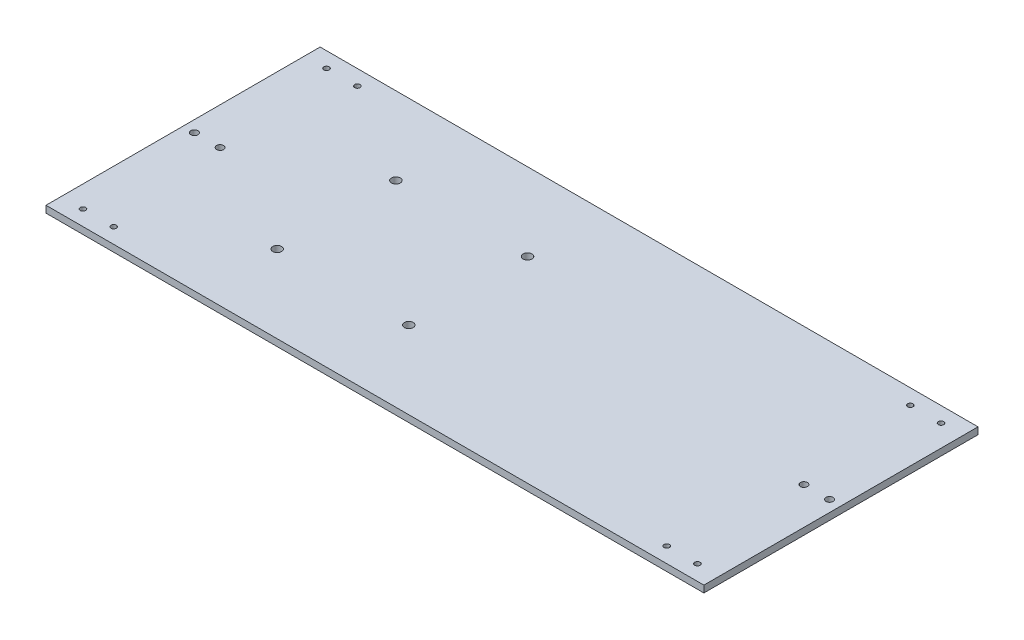
ISO-10303-21;
HEADER;
FILE_DESCRIPTION(('STEP AP214'),'2;1');
FILE_NAME('part.step','',(''),(''),'','','');
FILE_SCHEMA(('AUTOMOTIVE_DESIGN { 1 0 10303 214 1 1 1 1 }'));
ENDSEC;
DATA;
#1=APPLICATION_CONTEXT('core data for automotive mechanical design processes');
#2=APPLICATION_PROTOCOL_DEFINITION('international standard','automotive_design',2000,#1);
#3=PRODUCT_CONTEXT('',#1,'mechanical');
#4=PRODUCT('Part','Part','',(#3));
#5=PRODUCT_RELATED_PRODUCT_CATEGORY('part','',(#4));
#6=PRODUCT_DEFINITION_FORMATION('','',#4);
#7=PRODUCT_DEFINITION_CONTEXT('part definition',#1,'design');
#8=PRODUCT_DEFINITION('design','',#6,#7);
#9=PRODUCT_DEFINITION_SHAPE('','',#8);
#10=(LENGTH_UNIT() NAMED_UNIT(*) SI_UNIT(.MILLI.,.METRE.));
#11=(NAMED_UNIT(*) PLANE_ANGLE_UNIT() SI_UNIT($,.RADIAN.));
#12=(NAMED_UNIT(*) SI_UNIT($,.STERADIAN.) SOLID_ANGLE_UNIT());
#13=UNCERTAINTY_MEASURE_WITH_UNIT(LENGTH_MEASURE(1.E-05),#10,'distance_accuracy_value','');
#14=(GEOMETRIC_REPRESENTATION_CONTEXT(3) GLOBAL_UNCERTAINTY_ASSIGNED_CONTEXT((#13)) GLOBAL_UNIT_ASSIGNED_CONTEXT((#10,
#11,#12)) REPRESENTATION_CONTEXT('',''));
#15=CARTESIAN_POINT('',(0.,0.,0.));
#16=DIRECTION('',(0.,0.,1.));
#17=DIRECTION('',(1.,0.,0.));
#18=AXIS2_PLACEMENT_3D('',#15,#16,#17);
#19=CARTESIAN_POINT('',(0.,6.35,0.));
#20=DIRECTION('',(0.,-1.,0.));
#21=DIRECTION('',(0.,0.,-1.));
#22=AXIS2_PLACEMENT_3D('',#19,#20,#21);
#23=PLANE('',#22);
#24=DIRECTION('',(1.,0.,0.));
#25=VECTOR('',#24,1.);
#26=CARTESIAN_POINT('',(0.,6.35,0.));
#27=LINE('',#26,#25);
#28=CARTESIAN_POINT('',(0.,6.35,0.));
#29=VERTEX_POINT('',#28);
#30=CARTESIAN_POINT('',(609.6,6.35,0.));
#31=VERTEX_POINT('',#30);
#32=EDGE_CURVE('E85',#29,#31,#27,.T.);
#33=ORIENTED_EDGE('',*,*,#32,.T.);
#34=DIRECTION('',(0.,0.,-1.));
#35=VECTOR('',#34,1.);
#36=CARTESIAN_POINT('',(609.6,6.35,-254.));
#37=LINE('',#36,#35);
#38=CARTESIAN_POINT('',(609.6,6.35,-254.));
#39=VERTEX_POINT('',#38);
#40=EDGE_CURVE('E80',#31,#39,#37,.T.);
#41=ORIENTED_EDGE('',*,*,#40,.T.);
#42=DIRECTION('',(-1.,0.,0.));
#43=VECTOR('',#42,1.);
#44=CARTESIAN_POINT('',(0.,6.35,-254.));
#45=LINE('',#44,#43);
#46=CARTESIAN_POINT('',(0.,6.35,-254.));
#47=VERTEX_POINT('',#46);
#48=EDGE_CURVE('E83',#39,#47,#45,.T.);
#49=ORIENTED_EDGE('',*,*,#48,.T.);
#50=DIRECTION('',(0.,0.,1.));
#51=VECTOR('',#50,1.);
#52=CARTESIAN_POINT('',(0.,6.35,0.));
#53=LINE('',#52,#51);
#54=EDGE_CURVE('E50',#47,#29,#53,.T.);
#55=ORIENTED_EDGE('',*,*,#54,.T.);
#56=EDGE_LOOP('',(#33,#41,#49,#55));
#57=FACE_BOUND('',#56,.T.);
#58=CARTESIAN_POINT('',(20.1062344075867,6.35,-14.145554391547));
#59=DIRECTION('',(0.,1.,0.));
#60=DIRECTION('',(0.,0.,1.));
#61=AXIS2_PLACEMENT_3D('',#58,#59,#60);
#62=CIRCLE('',#61,2.5);
#63=CARTESIAN_POINT('',(20.1062344075867,6.35,-11.645554391547));
#64=VERTEX_POINT('',#63);
#65=EDGE_CURVE('E100',#64,#64,#62,.T.);
#66=ORIENTED_EDGE('',*,*,#65,.F.);
#67=EDGE_LOOP('',(#66));
#68=FACE_BOUND('',#67,.T.);
#69=CARTESIAN_POINT('',(48.6062344075867,6.35,-14.145554391547));
#70=DIRECTION('',(0.,1.,0.));
#71=DIRECTION('',(0.,0.,1.));
#72=AXIS2_PLACEMENT_3D('',#69,#70,#71);
#73=CIRCLE('',#72,2.49999999999999);
#74=CARTESIAN_POINT('',(48.6062344075867,6.35,-11.645554391547));
#75=VERTEX_POINT('',#74);
#76=EDGE_CURVE('E115',#75,#75,#73,.T.);
#77=ORIENTED_EDGE('',*,*,#76,.F.);
#78=EDGE_LOOP('',(#77));
#79=FACE_BOUND('',#78,.T.);
#80=CARTESIAN_POINT('',(560.993765592413,6.35,-14.1455543915467));
#81=DIRECTION('',(0.,1.,0.));
#82=DIRECTION('',(0.,0.,-1.));
#83=AXIS2_PLACEMENT_3D('',#80,#81,#82);
#84=CIRCLE('',#83,2.50000000000013);
#85=CARTESIAN_POINT('',(560.993765592413,6.35,-16.6455543915469));
#86=VERTEX_POINT('',#85);
#87=EDGE_CURVE('E121',#86,#86,#84,.T.);
#88=ORIENTED_EDGE('',*,*,#87,.F.);
#89=EDGE_LOOP('',(#88));
#90=FACE_BOUND('',#89,.T.);
#91=CARTESIAN_POINT('',(589.493765592413,6.35,-14.1455543915467));
#92=DIRECTION('',(0.,1.,0.));
#93=DIRECTION('',(0.,0.,-1.));
#94=AXIS2_PLACEMENT_3D('',#91,#92,#93);
#95=CIRCLE('',#94,2.49999999999992);
#96=CARTESIAN_POINT('',(589.493765592413,6.35,-16.6455543915466));
#97=VERTEX_POINT('',#96);
#98=EDGE_CURVE('E127',#97,#97,#95,.T.);
#99=ORIENTED_EDGE('',*,*,#98,.F.);
#100=EDGE_LOOP('',(#99));
#101=FACE_BOUND('',#100,.T.);
#102=CARTESIAN_POINT('',(589.493765592413,6.35,-239.854445608453));
#103=DIRECTION('',(0.,1.,0.));
#104=DIRECTION('',(0.,0.,1.));
#105=AXIS2_PLACEMENT_3D('',#102,#103,#104);
#106=CIRCLE('',#105,2.49999999999992);
#107=CARTESIAN_POINT('',(589.493765592413,6.35,-237.354445608453));
#108=VERTEX_POINT('',#107);
#109=EDGE_CURVE('E133',#108,#108,#106,.T.);
#110=ORIENTED_EDGE('',*,*,#109,.F.);
#111=EDGE_LOOP('',(#110));
#112=FACE_BOUND('',#111,.T.);
#113=CARTESIAN_POINT('',(560.993765592413,6.35,-239.854445608453));
#114=DIRECTION('',(0.,1.,0.));
#115=DIRECTION('',(0.,0.,1.));
#116=AXIS2_PLACEMENT_3D('',#113,#114,#115);
#117=CIRCLE('',#116,2.50000000000013);
#118=CARTESIAN_POINT('',(560.993765592413,6.35,-237.354445608453));
#119=VERTEX_POINT('',#118);
#120=EDGE_CURVE('E139',#119,#119,#117,.T.);
#121=ORIENTED_EDGE('',*,*,#120,.F.);
#122=EDGE_LOOP('',(#121));
#123=FACE_BOUND('',#122,.T.);
#124=CARTESIAN_POINT('',(48.6062344075867,6.35,-239.854445608453));
#125=DIRECTION('',(0.,1.,0.));
#126=DIRECTION('',(0.,0.,-1.));
#127=AXIS2_PLACEMENT_3D('',#124,#125,#126);
#128=CIRCLE('',#127,2.5);
#129=CARTESIAN_POINT('',(48.6062344075867,6.35,-242.354445608453));
#130=VERTEX_POINT('',#129);
#131=EDGE_CURVE('E145',#130,#130,#128,.T.);
#132=ORIENTED_EDGE('',*,*,#131,.F.);
#133=EDGE_LOOP('',(#132));
#134=FACE_BOUND('',#133,.T.);
#135=CARTESIAN_POINT('',(20.1062344075867,6.35,-239.854445608453));
#136=DIRECTION('',(0.,1.,0.));
#137=DIRECTION('',(0.,0.,-1.));
#138=AXIS2_PLACEMENT_3D('',#135,#136,#137);
#139=CIRCLE('',#138,2.5);
#140=CARTESIAN_POINT('',(20.1062344075867,6.35,-242.354445608453));
#141=VERTEX_POINT('',#140);
#142=EDGE_CURVE('E151',#141,#141,#139,.T.);
#143=ORIENTED_EDGE('',*,*,#142,.F.);
#144=EDGE_LOOP('',(#143));
#145=FACE_BOUND('',#144,.T.);
#146=CARTESIAN_POINT('',(575.243765592413,6.35,-127.));
#147=DIRECTION('',(0.,1.,0.));
#148=DIRECTION('',(0.,0.,1.));
#149=AXIS2_PLACEMENT_3D('',#146,#147,#148);
#150=CIRCLE('',#149,3.30200000000002);
#151=CARTESIAN_POINT('',(575.243765592413,6.35,-123.698));
#152=VERTEX_POINT('',#151);
#153=EDGE_CURVE('E157',#152,#152,#150,.T.);
#154=ORIENTED_EDGE('',*,*,#153,.F.);
#155=EDGE_LOOP('',(#154));
#156=FACE_BOUND('',#155,.T.);
#157=CARTESIAN_POINT('',(599.056265592413,6.35,-127.));
#158=DIRECTION('',(0.,1.,0.));
#159=DIRECTION('',(0.,0.,1.));
#160=AXIS2_PLACEMENT_3D('',#157,#158,#159);
#161=CIRCLE('',#160,3.30200000000002);
#162=CARTESIAN_POINT('',(599.056265592413,6.35,-123.698));
#163=VERTEX_POINT('',#162);
#164=EDGE_CURVE('E163',#163,#163,#161,.T.);
#165=ORIENTED_EDGE('',*,*,#164,.F.);
#166=EDGE_LOOP('',(#165));
#167=FACE_BOUND('',#166,.T.);
#168=CARTESIAN_POINT('',(10.5437344075867,6.35,-127.));
#169=DIRECTION('',(0.,1.,0.));
#170=DIRECTION('',(0.,0.,1.));
#171=AXIS2_PLACEMENT_3D('',#168,#169,#170);
#172=CIRCLE('',#171,3.30200000000002);
#173=CARTESIAN_POINT('',(10.5437344075867,6.35,-123.698));
#174=VERTEX_POINT('',#173);
#175=EDGE_CURVE('E169',#174,#174,#172,.T.);
#176=ORIENTED_EDGE('',*,*,#175,.F.);
#177=EDGE_LOOP('',(#176));
#178=FACE_BOUND('',#177,.T.);
#179=CARTESIAN_POINT('',(34.3562344075867,6.35,-127.));
#180=DIRECTION('',(0.,1.,0.));
#181=DIRECTION('',(0.,0.,1.));
#182=AXIS2_PLACEMENT_3D('',#179,#180,#181);
#183=CIRCLE('',#182,3.30200000000002);
#184=CARTESIAN_POINT('',(34.3562344075867,6.35,-123.698));
#185=VERTEX_POINT('',#184);
#186=EDGE_CURVE('E175',#185,#185,#183,.T.);
#187=ORIENTED_EDGE('',*,*,#186,.F.);
#188=EDGE_LOOP('',(#187));
#189=FACE_BOUND('',#188,.T.);
#190=CARTESIAN_POINT('',(142.2,6.35,-72.));
#191=DIRECTION('',(0.,1.,0.));
#192=DIRECTION('',(0.,0.,1.));
#193=AXIS2_PLACEMENT_3D('',#190,#191,#192);
#194=CIRCLE('',#193,4.09999999999998);
#195=CARTESIAN_POINT('',(142.2,6.35,-67.9));
#196=VERTEX_POINT('',#195);
#197=EDGE_CURVE('E181',#196,#196,#194,.T.);
#198=ORIENTED_EDGE('',*,*,#197,.F.);
#199=EDGE_LOOP('',(#198));
#200=FACE_BOUND('',#199,.T.);
#201=CARTESIAN_POINT('',(142.2,6.35,-182.));
#202=DIRECTION('',(0.,1.,0.));
#203=DIRECTION('',(0.,0.,1.));
#204=AXIS2_PLACEMENT_3D('',#201,#202,#203);
#205=CIRCLE('',#204,4.09999999999998);
#206=CARTESIAN_POINT('',(142.2,6.35,-177.9));
#207=VERTEX_POINT('',#206);
#208=EDGE_CURVE('E187',#207,#207,#205,.T.);
#209=ORIENTED_EDGE('',*,*,#208,.F.);
#210=EDGE_LOOP('',(#209));
#211=FACE_BOUND('',#210,.T.);
#212=CARTESIAN_POINT('',(264.2,6.35,-182.));
#213=DIRECTION('',(0.,1.,0.));
#214=DIRECTION('',(0.,0.,-1.));
#215=AXIS2_PLACEMENT_3D('',#212,#213,#214);
#216=CIRCLE('',#215,4.10000000000004);
#217=CARTESIAN_POINT('',(264.2,6.35,-186.1));
#218=VERTEX_POINT('',#217);
#219=EDGE_CURVE('E193',#218,#218,#216,.T.);
#220=ORIENTED_EDGE('',*,*,#219,.F.);
#221=EDGE_LOOP('',(#220));
#222=FACE_BOUND('',#221,.T.);
#223=CARTESIAN_POINT('',(264.2,6.35,-72.));
#224=DIRECTION('',(0.,1.,0.));
#225=DIRECTION('',(0.,0.,-1.));
#226=AXIS2_PLACEMENT_3D('',#223,#224,#225);
#227=CIRCLE('',#226,4.10000000000004);
#228=CARTESIAN_POINT('',(264.2,6.35,-76.1));
#229=VERTEX_POINT('',#228);
#230=EDGE_CURVE('E199',#229,#229,#227,.T.);
#231=ORIENTED_EDGE('',*,*,#230,.F.);
#232=EDGE_LOOP('',(#231));
#233=FACE_BOUND('',#232,.T.);
#234=ADVANCED_FACE('F33',(#57,#68,#79,#90,#101,#112,#123,#134,#145,#156,#167,#178,#189,#200,
#211,#222,#233),#23,.F.);
#235=CARTESIAN_POINT('',(0.,0.,0.));
#236=DIRECTION('',(0.,-1.,0.));
#237=DIRECTION('',(0.,0.,-1.));
#238=AXIS2_PLACEMENT_3D('',#235,#236,#237);
#239=PLANE('',#238);
#240=CARTESIAN_POINT('',(264.2,0.,-182.));
#241=DIRECTION('',(0.,1.,0.));
#242=DIRECTION('',(0.,0.,-1.));
#243=AXIS2_PLACEMENT_3D('',#240,#241,#242);
#244=CIRCLE('',#243,4.10000000000004);
#245=CARTESIAN_POINT('',(264.2,0.,-186.1));
#246=VERTEX_POINT('',#245);
#247=EDGE_CURVE('E196',#246,#246,#244,.T.);
#248=ORIENTED_EDGE('',*,*,#247,.T.);
#249=EDGE_LOOP('',(#248));
#250=FACE_BOUND('',#249,.T.);
#251=CARTESIAN_POINT('',(142.2,0.,-72.));
#252=DIRECTION('',(0.,1.,0.));
#253=DIRECTION('',(0.,0.,1.));
#254=AXIS2_PLACEMENT_3D('',#251,#252,#253);
#255=CIRCLE('',#254,4.09999999999998);
#256=CARTESIAN_POINT('',(142.2,0.,-67.9));
#257=VERTEX_POINT('',#256);
#258=EDGE_CURVE('E184',#257,#257,#255,.T.);
#259=ORIENTED_EDGE('',*,*,#258,.T.);
#260=EDGE_LOOP('',(#259));
#261=FACE_BOUND('',#260,.T.);
#262=CARTESIAN_POINT('',(10.5437344075867,0.,-127.));
#263=DIRECTION('',(0.,1.,0.));
#264=DIRECTION('',(0.,0.,1.));
#265=AXIS2_PLACEMENT_3D('',#262,#263,#264);
#266=CIRCLE('',#265,3.30200000000002);
#267=CARTESIAN_POINT('',(10.5437344075867,0.,-123.698));
#268=VERTEX_POINT('',#267);
#269=EDGE_CURVE('E172',#268,#268,#266,.T.);
#270=ORIENTED_EDGE('',*,*,#269,.T.);
#271=EDGE_LOOP('',(#270));
#272=FACE_BOUND('',#271,.T.);
#273=CARTESIAN_POINT('',(575.243765592413,0.,-127.));
#274=DIRECTION('',(0.,1.,0.));
#275=DIRECTION('',(0.,0.,1.));
#276=AXIS2_PLACEMENT_3D('',#273,#274,#275);
#277=CIRCLE('',#276,3.30200000000002);
#278=CARTESIAN_POINT('',(575.243765592413,0.,-123.698));
#279=VERTEX_POINT('',#278);
#280=EDGE_CURVE('E160',#279,#279,#277,.T.);
#281=ORIENTED_EDGE('',*,*,#280,.T.);
#282=EDGE_LOOP('',(#281));
#283=FACE_BOUND('',#282,.T.);
#284=CARTESIAN_POINT('',(48.6062344075867,0.,-239.854445608453));
#285=DIRECTION('',(0.,1.,0.));
#286=DIRECTION('',(0.,0.,-1.));
#287=AXIS2_PLACEMENT_3D('',#284,#285,#286);
#288=CIRCLE('',#287,2.5);
#289=CARTESIAN_POINT('',(48.6062344075867,0.,-242.354445608453));
#290=VERTEX_POINT('',#289);
#291=EDGE_CURVE('E148',#290,#290,#288,.T.);
#292=ORIENTED_EDGE('',*,*,#291,.T.);
#293=EDGE_LOOP('',(#292));
#294=FACE_BOUND('',#293,.T.);
#295=CARTESIAN_POINT('',(589.493765592413,0.,-239.854445608453));
#296=DIRECTION('',(0.,1.,0.));
#297=DIRECTION('',(0.,0.,1.));
#298=AXIS2_PLACEMENT_3D('',#295,#296,#297);
#299=CIRCLE('',#298,2.49999999999992);
#300=CARTESIAN_POINT('',(589.493765592413,0.,-237.354445608453));
#301=VERTEX_POINT('',#300);
#302=EDGE_CURVE('E136',#301,#301,#299,.T.);
#303=ORIENTED_EDGE('',*,*,#302,.T.);
#304=EDGE_LOOP('',(#303));
#305=FACE_BOUND('',#304,.T.);
#306=CARTESIAN_POINT('',(560.993765592413,0.,-14.1455543915467));
#307=DIRECTION('',(0.,1.,0.));
#308=DIRECTION('',(0.,0.,-1.));
#309=AXIS2_PLACEMENT_3D('',#306,#307,#308);
#310=CIRCLE('',#309,2.50000000000013);
#311=CARTESIAN_POINT('',(560.993765592413,0.,-16.6455543915469));
#312=VERTEX_POINT('',#311);
#313=EDGE_CURVE('E124',#312,#312,#310,.T.);
#314=ORIENTED_EDGE('',*,*,#313,.T.);
#315=EDGE_LOOP('',(#314));
#316=FACE_BOUND('',#315,.T.);
#317=CARTESIAN_POINT('',(20.1062344075867,0.,-14.145554391547));
#318=DIRECTION('',(0.,1.,0.));
#319=DIRECTION('',(0.,0.,1.));
#320=AXIS2_PLACEMENT_3D('',#317,#318,#319);
#321=CIRCLE('',#320,2.5);
#322=CARTESIAN_POINT('',(20.1062344075867,0.,-11.645554391547));
#323=VERTEX_POINT('',#322);
#324=EDGE_CURVE('E112',#323,#323,#321,.T.);
#325=ORIENTED_EDGE('',*,*,#324,.T.);
#326=EDGE_LOOP('',(#325));
#327=FACE_BOUND('',#326,.T.);
#328=DIRECTION('',(1.,0.,0.));
#329=VECTOR('',#328,1.);
#330=CARTESIAN_POINT('',(0.,0.,0.));
#331=LINE('',#330,#329);
#332=CARTESIAN_POINT('',(0.,0.,0.));
#333=VERTEX_POINT('',#332);
#334=CARTESIAN_POINT('',(609.6,0.,0.));
#335=VERTEX_POINT('',#334);
#336=EDGE_CURVE('E97',#333,#335,#331,.T.);
#337=ORIENTED_EDGE('',*,*,#336,.F.);
#338=DIRECTION('',(0.,0.,1.));
#339=VECTOR('',#338,1.);
#340=CARTESIAN_POINT('',(0.,0.,0.));
#341=LINE('',#340,#339);
#342=CARTESIAN_POINT('',(0.,0.,-254.));
#343=VERTEX_POINT('',#342);
#344=EDGE_CURVE('E73',#343,#333,#341,.T.);
#345=ORIENTED_EDGE('',*,*,#344,.F.);
#346=DIRECTION('',(-1.,0.,0.));
#347=VECTOR('',#346,1.);
#348=CARTESIAN_POINT('',(0.,0.,-254.));
#349=LINE('',#348,#347);
#350=CARTESIAN_POINT('',(609.6,0.,-254.));
#351=VERTEX_POINT('',#350);
#352=EDGE_CURVE('E67',#351,#343,#349,.T.);
#353=ORIENTED_EDGE('',*,*,#352,.F.);
#354=DIRECTION('',(0.,0.,-1.));
#355=VECTOR('',#354,1.);
#356=CARTESIAN_POINT('',(609.6,0.,-254.));
#357=LINE('',#356,#355);
#358=EDGE_CURVE('E89',#335,#351,#357,.T.);
#359=ORIENTED_EDGE('',*,*,#358,.F.);
#360=EDGE_LOOP('',(#337,#345,#353,#359));
#361=FACE_BOUND('',#360,.T.);
#362=CARTESIAN_POINT('',(48.6062344075867,0.,-14.145554391547));
#363=DIRECTION('',(0.,1.,0.));
#364=DIRECTION('',(0.,0.,1.));
#365=AXIS2_PLACEMENT_3D('',#362,#363,#364);
#366=CIRCLE('',#365,2.49999999999999);
#367=CARTESIAN_POINT('',(48.6062344075867,0.,-11.645554391547));
#368=VERTEX_POINT('',#367);
#369=EDGE_CURVE('E118',#368,#368,#366,.T.);
#370=ORIENTED_EDGE('',*,*,#369,.T.);
#371=EDGE_LOOP('',(#370));
#372=FACE_BOUND('',#371,.T.);
#373=CARTESIAN_POINT('',(589.493765592413,0.,-14.1455543915467));
#374=DIRECTION('',(0.,1.,0.));
#375=DIRECTION('',(0.,0.,-1.));
#376=AXIS2_PLACEMENT_3D('',#373,#374,#375);
#377=CIRCLE('',#376,2.49999999999992);
#378=CARTESIAN_POINT('',(589.493765592413,0.,-16.6455543915466));
#379=VERTEX_POINT('',#378);
#380=EDGE_CURVE('E130',#379,#379,#377,.T.);
#381=ORIENTED_EDGE('',*,*,#380,.T.);
#382=EDGE_LOOP('',(#381));
#383=FACE_BOUND('',#382,.T.);
#384=CARTESIAN_POINT('',(560.993765592413,0.,-239.854445608453));
#385=DIRECTION('',(0.,1.,0.));
#386=DIRECTION('',(0.,0.,1.));
#387=AXIS2_PLACEMENT_3D('',#384,#385,#386);
#388=CIRCLE('',#387,2.50000000000013);
#389=CARTESIAN_POINT('',(560.993765592413,0.,-237.354445608453));
#390=VERTEX_POINT('',#389);
#391=EDGE_CURVE('E142',#390,#390,#388,.T.);
#392=ORIENTED_EDGE('',*,*,#391,.T.);
#393=EDGE_LOOP('',(#392));
#394=FACE_BOUND('',#393,.T.);
#395=CARTESIAN_POINT('',(20.1062344075867,0.,-239.854445608453));
#396=DIRECTION('',(0.,1.,0.));
#397=DIRECTION('',(0.,0.,-1.));
#398=AXIS2_PLACEMENT_3D('',#395,#396,#397);
#399=CIRCLE('',#398,2.5);
#400=CARTESIAN_POINT('',(20.1062344075867,0.,-242.354445608453));
#401=VERTEX_POINT('',#400);
#402=EDGE_CURVE('E154',#401,#401,#399,.T.);
#403=ORIENTED_EDGE('',*,*,#402,.T.);
#404=EDGE_LOOP('',(#403));
#405=FACE_BOUND('',#404,.T.);
#406=CARTESIAN_POINT('',(599.056265592413,0.,-127.));
#407=DIRECTION('',(0.,1.,0.));
#408=DIRECTION('',(0.,0.,1.));
#409=AXIS2_PLACEMENT_3D('',#406,#407,#408);
#410=CIRCLE('',#409,3.30200000000002);
#411=CARTESIAN_POINT('',(599.056265592413,0.,-123.698));
#412=VERTEX_POINT('',#411);
#413=EDGE_CURVE('E166',#412,#412,#410,.T.);
#414=ORIENTED_EDGE('',*,*,#413,.T.);
#415=EDGE_LOOP('',(#414));
#416=FACE_BOUND('',#415,.T.);
#417=CARTESIAN_POINT('',(34.3562344075867,0.,-127.));
#418=DIRECTION('',(0.,1.,0.));
#419=DIRECTION('',(0.,0.,1.));
#420=AXIS2_PLACEMENT_3D('',#417,#418,#419);
#421=CIRCLE('',#420,3.30200000000002);
#422=CARTESIAN_POINT('',(34.3562344075867,0.,-123.698));
#423=VERTEX_POINT('',#422);
#424=EDGE_CURVE('E178',#423,#423,#421,.T.);
#425=ORIENTED_EDGE('',*,*,#424,.T.);
#426=EDGE_LOOP('',(#425));
#427=FACE_BOUND('',#426,.T.);
#428=CARTESIAN_POINT('',(142.2,0.,-182.));
#429=DIRECTION('',(0.,1.,0.));
#430=DIRECTION('',(0.,0.,1.));
#431=AXIS2_PLACEMENT_3D('',#428,#429,#430);
#432=CIRCLE('',#431,4.09999999999998);
#433=CARTESIAN_POINT('',(142.2,0.,-177.9));
#434=VERTEX_POINT('',#433);
#435=EDGE_CURVE('E190',#434,#434,#432,.T.);
#436=ORIENTED_EDGE('',*,*,#435,.T.);
#437=EDGE_LOOP('',(#436));
#438=FACE_BOUND('',#437,.T.);
#439=CARTESIAN_POINT('',(264.2,0.,-72.));
#440=DIRECTION('',(0.,1.,0.));
#441=DIRECTION('',(0.,0.,-1.));
#442=AXIS2_PLACEMENT_3D('',#439,#440,#441);
#443=CIRCLE('',#442,4.10000000000004);
#444=CARTESIAN_POINT('',(264.2,0.,-76.1));
#445=VERTEX_POINT('',#444);
#446=EDGE_CURVE('E202',#445,#445,#443,.T.);
#447=ORIENTED_EDGE('',*,*,#446,.T.);
#448=EDGE_LOOP('',(#447));
#449=FACE_BOUND('',#448,.T.);
#450=ADVANCED_FACE('F108',(#250,#261,#272,#283,#294,#305,#316,#327,#361,#372,#383,#394,#405,
#416,#427,#438,#449),#239,.T.);
#451=CARTESIAN_POINT('',(0.,6.35,0.));
#452=DIRECTION('',(0.,0.,-1.));
#453=DIRECTION('',(-1.,0.,0.));
#454=AXIS2_PLACEMENT_3D('',#451,#452,#453);
#455=PLANE('',#454);
#456=ORIENTED_EDGE('',*,*,#336,.T.);
#457=DIRECTION('',(0.,-1.,0.));
#458=VECTOR('',#457,1.);
#459=CARTESIAN_POINT('',(609.6,6.35,0.));
#460=LINE('',#459,#458);
#461=EDGE_CURVE('E11',#31,#335,#460,.T.);
#462=ORIENTED_EDGE('',*,*,#461,.F.);
#463=ORIENTED_EDGE('',*,*,#32,.F.);
#464=DIRECTION('',(0.,-1.,0.));
#465=VECTOR('',#464,1.);
#466=CARTESIAN_POINT('',(0.,6.35,0.));
#467=LINE('',#466,#465);
#468=EDGE_CURVE('E93',#29,#333,#467,.T.);
#469=ORIENTED_EDGE('',*,*,#468,.T.);
#470=EDGE_LOOP('',(#456,#462,#463,#469));
#471=FACE_BOUND('',#470,.T.);
#472=ADVANCED_FACE('F35',(#471),#455,.F.);
#473=CARTESIAN_POINT('',(609.6,6.35,-254.));
#474=DIRECTION('',(-1.,0.,0.));
#475=DIRECTION('',(0.,0.,1.));
#476=AXIS2_PLACEMENT_3D('',#473,#474,#475);
#477=PLANE('',#476);
#478=ORIENTED_EDGE('',*,*,#358,.T.);
#479=DIRECTION('',(0.,-1.,0.));
#480=VECTOR('',#479,1.);
#481=CARTESIAN_POINT('',(609.6,6.35,-254.));
#482=LINE('',#481,#480);
#483=EDGE_CURVE('E42',#39,#351,#482,.T.);
#484=ORIENTED_EDGE('',*,*,#483,.F.);
#485=ORIENTED_EDGE('',*,*,#40,.F.);
#486=ORIENTED_EDGE('',*,*,#461,.T.);
#487=EDGE_LOOP('',(#478,#484,#485,#486));
#488=FACE_BOUND('',#487,.T.);
#489=ADVANCED_FACE('F88',(#488),#477,.F.);
#490=CARTESIAN_POINT('',(0.,6.35,-254.));
#491=DIRECTION('',(0.,0.,1.));
#492=DIRECTION('',(1.,0.,0.));
#493=AXIS2_PLACEMENT_3D('',#490,#491,#492);
#494=PLANE('',#493);
#495=ORIENTED_EDGE('',*,*,#352,.T.);
#496=DIRECTION('',(0.,-1.,0.));
#497=VECTOR('',#496,1.);
#498=CARTESIAN_POINT('',(0.,6.35,-254.));
#499=LINE('',#498,#497);
#500=EDGE_CURVE('E90',#47,#343,#499,.T.);
#501=ORIENTED_EDGE('',*,*,#500,.F.);
#502=ORIENTED_EDGE('',*,*,#48,.F.);
#503=ORIENTED_EDGE('',*,*,#483,.T.);
#504=EDGE_LOOP('',(#495,#501,#502,#503));
#505=FACE_BOUND('',#504,.T.);
#506=ADVANCED_FACE('F91',(#505),#494,.F.);
#507=CARTESIAN_POINT('',(0.,6.35,0.));
#508=DIRECTION('',(1.,0.,0.));
#509=DIRECTION('',(0.,0.,-1.));
#510=AXIS2_PLACEMENT_3D('',#507,#508,#509);
#511=PLANE('',#510);
#512=ORIENTED_EDGE('',*,*,#344,.T.);
#513=ORIENTED_EDGE('',*,*,#468,.F.);
#514=ORIENTED_EDGE('',*,*,#54,.F.);
#515=ORIENTED_EDGE('',*,*,#500,.T.);
#516=EDGE_LOOP('',(#512,#513,#514,#515));
#517=FACE_BOUND('',#516,.T.);
#518=ADVANCED_FACE('F105',(#517),#511,.F.);
#519=CARTESIAN_POINT('',(20.1062344075867,6.35,-14.145554391547));
#520=DIRECTION('',(0.,-1.,0.));
#521=DIRECTION('',(0.,0.,-1.));
#522=AXIS2_PLACEMENT_3D('',#519,#520,#521);
#523=CYLINDRICAL_SURFACE('',#522,2.5);
#524=ORIENTED_EDGE('',*,*,#65,.T.);
#525=EDGE_LOOP('',(#524));
#526=FACE_BOUND('',#525,.T.);
#527=ORIENTED_EDGE('',*,*,#324,.F.);
#528=EDGE_LOOP('',(#527));
#529=FACE_BOUND('',#528,.T.);
#530=ADVANCED_FACE('F219',(#526,#529),#523,.F.);
#531=CARTESIAN_POINT('',(48.6062344075867,6.35,-14.145554391547));
#532=DIRECTION('',(0.,-1.,0.));
#533=DIRECTION('',(0.,0.,-1.));
#534=AXIS2_PLACEMENT_3D('',#531,#532,#533);
#535=CYLINDRICAL_SURFACE('',#534,2.49999999999999);
#536=ORIENTED_EDGE('',*,*,#76,.T.);
#537=EDGE_LOOP('',(#536));
#538=FACE_BOUND('',#537,.T.);
#539=ORIENTED_EDGE('',*,*,#369,.F.);
#540=EDGE_LOOP('',(#539));
#541=FACE_BOUND('',#540,.T.);
#542=ADVANCED_FACE('F265',(#538,#541),#535,.F.);
#543=CARTESIAN_POINT('',(560.993765592413,6.35,-14.1455543915467));
#544=DIRECTION('',(0.,-1.,0.));
#545=DIRECTION('',(0.,0.,-1.));
#546=AXIS2_PLACEMENT_3D('',#543,#544,#545);
#547=CYLINDRICAL_SURFACE('',#546,2.50000000000013);
#548=ORIENTED_EDGE('',*,*,#87,.T.);
#549=EDGE_LOOP('',(#548));
#550=FACE_BOUND('',#549,.T.);
#551=ORIENTED_EDGE('',*,*,#313,.F.);
#552=EDGE_LOOP('',(#551));
#553=FACE_BOUND('',#552,.T.);
#554=ADVANCED_FACE('F273',(#550,#553),#547,.F.);
#555=CARTESIAN_POINT('',(589.493765592413,6.35,-14.1455543915467));
#556=DIRECTION('',(0.,-1.,0.));
#557=DIRECTION('',(0.,0.,-1.));
#558=AXIS2_PLACEMENT_3D('',#555,#556,#557);
#559=CYLINDRICAL_SURFACE('',#558,2.49999999999992);
#560=ORIENTED_EDGE('',*,*,#98,.T.);
#561=EDGE_LOOP('',(#560));
#562=FACE_BOUND('',#561,.T.);
#563=ORIENTED_EDGE('',*,*,#380,.F.);
#564=EDGE_LOOP('',(#563));
#565=FACE_BOUND('',#564,.T.);
#566=ADVANCED_FACE('F281',(#562,#565),#559,.F.);
#567=CARTESIAN_POINT('',(589.493765592413,6.35,-239.854445608453));
#568=DIRECTION('',(0.,-1.,0.));
#569=DIRECTION('',(0.,0.,-1.));
#570=AXIS2_PLACEMENT_3D('',#567,#568,#569);
#571=CYLINDRICAL_SURFACE('',#570,2.49999999999992);
#572=ORIENTED_EDGE('',*,*,#109,.T.);
#573=EDGE_LOOP('',(#572));
#574=FACE_BOUND('',#573,.T.);
#575=ORIENTED_EDGE('',*,*,#302,.F.);
#576=EDGE_LOOP('',(#575));
#577=FACE_BOUND('',#576,.T.);
#578=ADVANCED_FACE('F290',(#574,#577),#571,.F.);
#579=CARTESIAN_POINT('',(560.993765592413,6.35,-239.854445608453));
#580=DIRECTION('',(0.,-1.,0.));
#581=DIRECTION('',(0.,0.,-1.));
#582=AXIS2_PLACEMENT_3D('',#579,#580,#581);
#583=CYLINDRICAL_SURFACE('',#582,2.50000000000013);
#584=ORIENTED_EDGE('',*,*,#120,.T.);
#585=EDGE_LOOP('',(#584));
#586=FACE_BOUND('',#585,.T.);
#587=ORIENTED_EDGE('',*,*,#391,.F.);
#588=EDGE_LOOP('',(#587));
#589=FACE_BOUND('',#588,.T.);
#590=ADVANCED_FACE('F299',(#586,#589),#583,.F.);
#591=CARTESIAN_POINT('',(48.6062344075867,6.35,-239.854445608453));
#592=DIRECTION('',(0.,-1.,0.));
#593=DIRECTION('',(0.,0.,-1.));
#594=AXIS2_PLACEMENT_3D('',#591,#592,#593);
#595=CYLINDRICAL_SURFACE('',#594,2.5);
#596=ORIENTED_EDGE('',*,*,#131,.T.);
#597=EDGE_LOOP('',(#596));
#598=FACE_BOUND('',#597,.T.);
#599=ORIENTED_EDGE('',*,*,#291,.F.);
#600=EDGE_LOOP('',(#599));
#601=FACE_BOUND('',#600,.T.);
#602=ADVANCED_FACE('F308',(#598,#601),#595,.F.);
#603=CARTESIAN_POINT('',(20.1062344075867,6.35,-239.854445608453));
#604=DIRECTION('',(0.,-1.,0.));
#605=DIRECTION('',(0.,0.,-1.));
#606=AXIS2_PLACEMENT_3D('',#603,#604,#605);
#607=CYLINDRICAL_SURFACE('',#606,2.5);
#608=ORIENTED_EDGE('',*,*,#142,.T.);
#609=EDGE_LOOP('',(#608));
#610=FACE_BOUND('',#609,.T.);
#611=ORIENTED_EDGE('',*,*,#402,.F.);
#612=EDGE_LOOP('',(#611));
#613=FACE_BOUND('',#612,.T.);
#614=ADVANCED_FACE('F317',(#610,#613),#607,.F.);
#615=CARTESIAN_POINT('',(575.243765592413,6.35,-127.));
#616=DIRECTION('',(0.,-1.,0.));
#617=DIRECTION('',(0.,0.,-1.));
#618=AXIS2_PLACEMENT_3D('',#615,#616,#617);
#619=CYLINDRICAL_SURFACE('',#618,3.30200000000002);
#620=ORIENTED_EDGE('',*,*,#153,.T.);
#621=EDGE_LOOP('',(#620));
#622=FACE_BOUND('',#621,.T.);
#623=ORIENTED_EDGE('',*,*,#280,.F.);
#624=EDGE_LOOP('',(#623));
#625=FACE_BOUND('',#624,.T.);
#626=ADVANCED_FACE('F326',(#622,#625),#619,.F.);
#627=CARTESIAN_POINT('',(599.056265592413,6.35,-127.));
#628=DIRECTION('',(0.,-1.,0.));
#629=DIRECTION('',(0.,0.,-1.));
#630=AXIS2_PLACEMENT_3D('',#627,#628,#629);
#631=CYLINDRICAL_SURFACE('',#630,3.30200000000002);
#632=ORIENTED_EDGE('',*,*,#164,.T.);
#633=EDGE_LOOP('',(#632));
#634=FACE_BOUND('',#633,.T.);
#635=ORIENTED_EDGE('',*,*,#413,.F.);
#636=EDGE_LOOP('',(#635));
#637=FACE_BOUND('',#636,.T.);
#638=ADVANCED_FACE('F335',(#634,#637),#631,.F.);
#639=CARTESIAN_POINT('',(10.5437344075867,6.35,-127.));
#640=DIRECTION('',(0.,-1.,0.));
#641=DIRECTION('',(0.,0.,-1.));
#642=AXIS2_PLACEMENT_3D('',#639,#640,#641);
#643=CYLINDRICAL_SURFACE('',#642,3.30200000000002);
#644=ORIENTED_EDGE('',*,*,#175,.T.);
#645=EDGE_LOOP('',(#644));
#646=FACE_BOUND('',#645,.T.);
#647=ORIENTED_EDGE('',*,*,#269,.F.);
#648=EDGE_LOOP('',(#647));
#649=FACE_BOUND('',#648,.T.);
#650=ADVANCED_FACE('F344',(#646,#649),#643,.F.);
#651=CARTESIAN_POINT('',(34.3562344075867,6.35,-127.));
#652=DIRECTION('',(0.,-1.,0.));
#653=DIRECTION('',(0.,0.,-1.));
#654=AXIS2_PLACEMENT_3D('',#651,#652,#653);
#655=CYLINDRICAL_SURFACE('',#654,3.30200000000002);
#656=ORIENTED_EDGE('',*,*,#186,.T.);
#657=EDGE_LOOP('',(#656));
#658=FACE_BOUND('',#657,.T.);
#659=ORIENTED_EDGE('',*,*,#424,.F.);
#660=EDGE_LOOP('',(#659));
#661=FACE_BOUND('',#660,.T.);
#662=ADVANCED_FACE('F353',(#658,#661),#655,.F.);
#663=CARTESIAN_POINT('',(142.2,6.35,-72.));
#664=DIRECTION('',(0.,-1.,0.));
#665=DIRECTION('',(0.,0.,-1.));
#666=AXIS2_PLACEMENT_3D('',#663,#664,#665);
#667=CYLINDRICAL_SURFACE('',#666,4.09999999999998);
#668=ORIENTED_EDGE('',*,*,#197,.T.);
#669=EDGE_LOOP('',(#668));
#670=FACE_BOUND('',#669,.T.);
#671=ORIENTED_EDGE('',*,*,#258,.F.);
#672=EDGE_LOOP('',(#671));
#673=FACE_BOUND('',#672,.T.);
#674=ADVANCED_FACE('F362',(#670,#673),#667,.F.);
#675=CARTESIAN_POINT('',(142.2,6.35,-182.));
#676=DIRECTION('',(0.,-1.,0.));
#677=DIRECTION('',(0.,0.,-1.));
#678=AXIS2_PLACEMENT_3D('',#675,#676,#677);
#679=CYLINDRICAL_SURFACE('',#678,4.09999999999998);
#680=ORIENTED_EDGE('',*,*,#208,.T.);
#681=EDGE_LOOP('',(#680));
#682=FACE_BOUND('',#681,.T.);
#683=ORIENTED_EDGE('',*,*,#435,.F.);
#684=EDGE_LOOP('',(#683));
#685=FACE_BOUND('',#684,.T.);
#686=ADVANCED_FACE('F371',(#682,#685),#679,.F.);
#687=CARTESIAN_POINT('',(264.2,6.35,-182.));
#688=DIRECTION('',(0.,-1.,0.));
#689=DIRECTION('',(0.,0.,-1.));
#690=AXIS2_PLACEMENT_3D('',#687,#688,#689);
#691=CYLINDRICAL_SURFACE('',#690,4.10000000000004);
#692=ORIENTED_EDGE('',*,*,#219,.T.);
#693=EDGE_LOOP('',(#692));
#694=FACE_BOUND('',#693,.T.);
#695=ORIENTED_EDGE('',*,*,#247,.F.);
#696=EDGE_LOOP('',(#695));
#697=FACE_BOUND('',#696,.T.);
#698=ADVANCED_FACE('F380',(#694,#697),#691,.F.);
#699=CARTESIAN_POINT('',(264.2,6.35,-72.));
#700=DIRECTION('',(0.,-1.,0.));
#701=DIRECTION('',(0.,0.,-1.));
#702=AXIS2_PLACEMENT_3D('',#699,#700,#701);
#703=CYLINDRICAL_SURFACE('',#702,4.10000000000004);
#704=ORIENTED_EDGE('',*,*,#230,.T.);
#705=EDGE_LOOP('',(#704));
#706=FACE_BOUND('',#705,.T.);
#707=ORIENTED_EDGE('',*,*,#446,.F.);
#708=EDGE_LOOP('',(#707));
#709=FACE_BOUND('',#708,.T.);
#710=ADVANCED_FACE('F208',(#706,#709),#703,.F.);
#711=CLOSED_SHELL('',(#234,#450,#472,#489,#506,#518,#530,#542,#554,#566,#578,#590,#602,#614,
#626,#638,#650,#662,#674,#686,#698,#710));
#712=MANIFOLD_SOLID_BREP('B2',#711);
#713=ADVANCED_BREP_SHAPE_REPRESENTATION('',(#18,#712),#14);
#714=SHAPE_DEFINITION_REPRESENTATION(#9,#713);
ENDSEC;
END-ISO-10303-21;
